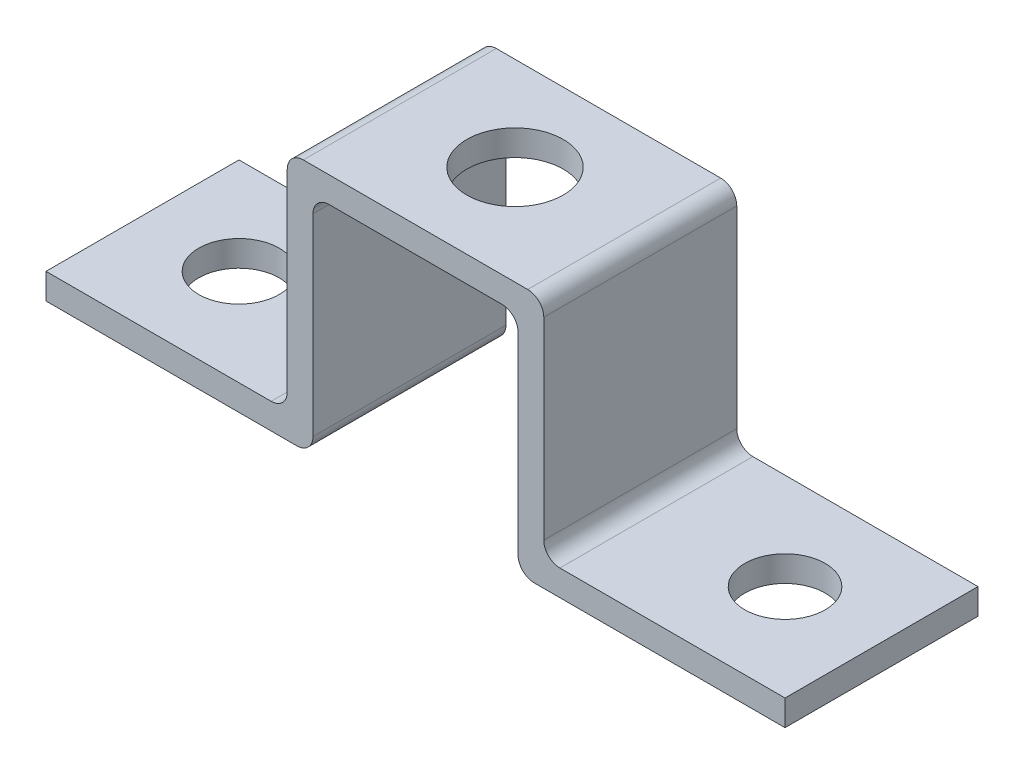
ISO-10303-21;
HEADER;
FILE_DESCRIPTION(('STEP AP214'),'2;1');
FILE_NAME('part.step','',(''),(''),'','','');
FILE_SCHEMA(('AUTOMOTIVE_DESIGN { 1 0 10303 214 1 1 1 1 }'));
ENDSEC;
DATA;
#1=APPLICATION_CONTEXT('core data for automotive mechanical design processes');
#2=APPLICATION_PROTOCOL_DEFINITION('international standard','automotive_design',2000,#1);
#3=PRODUCT_CONTEXT('',#1,'mechanical');
#4=PRODUCT('Part','Part','',(#3));
#5=PRODUCT_RELATED_PRODUCT_CATEGORY('part','',(#4));
#6=PRODUCT_DEFINITION_FORMATION('','',#4);
#7=PRODUCT_DEFINITION_CONTEXT('part definition',#1,'design');
#8=PRODUCT_DEFINITION('design','',#6,#7);
#9=PRODUCT_DEFINITION_SHAPE('','',#8);
#10=(LENGTH_UNIT() NAMED_UNIT(*) SI_UNIT(.MILLI.,.METRE.));
#11=(NAMED_UNIT(*) PLANE_ANGLE_UNIT() SI_UNIT($,.RADIAN.));
#12=(NAMED_UNIT(*) SI_UNIT($,.STERADIAN.) SOLID_ANGLE_UNIT());
#13=UNCERTAINTY_MEASURE_WITH_UNIT(LENGTH_MEASURE(1.E-05),#10,'distance_accuracy_value','');
#14=(GEOMETRIC_REPRESENTATION_CONTEXT(3) GLOBAL_UNCERTAINTY_ASSIGNED_CONTEXT((#13)) GLOBAL_UNIT_ASSIGNED_CONTEXT((#10,
#11,#12)) REPRESENTATION_CONTEXT('',''));
#15=CARTESIAN_POINT('',(0.,0.,0.));
#16=DIRECTION('',(0.,0.,1.));
#17=DIRECTION('',(1.,0.,0.));
#18=AXIS2_PLACEMENT_3D('',#15,#16,#17);
#19=CARTESIAN_POINT('',(-22.9767896358443,1.25105074490057,12.));
#20=DIRECTION('',(1.,0.,0.));
#21=DIRECTION('',(0.,0.,-1.));
#22=AXIS2_PLACEMENT_3D('',#19,#20,#21);
#23=PLANE('',#22);
#24=DIRECTION('',(0.,-1.,0.));
#25=VECTOR('',#24,1.);
#26=CARTESIAN_POINT('',(-22.9767896358443,1.25105074490057,0.));
#27=LINE('',#26,#25);
#28=CARTESIAN_POINT('',(-22.9767896358443,1.25105074490057,0.));
#29=VERTEX_POINT('',#28);
#30=CARTESIAN_POINT('',(-22.9767896358443,-0.348949255099432,0.));
#31=VERTEX_POINT('',#30);
#32=EDGE_CURVE('E194',#29,#31,#27,.T.);
#33=ORIENTED_EDGE('',*,*,#32,.T.);
#34=DIRECTION('',(0.,0.,-1.));
#35=VECTOR('',#34,1.);
#36=CARTESIAN_POINT('',(-22.9767896358443,-0.348949255099432,12.));
#37=LINE('',#36,#35);
#38=CARTESIAN_POINT('',(-22.9767896358443,-0.348949255099432,12.));
#39=VERTEX_POINT('',#38);
#40=EDGE_CURVE('E174',#39,#31,#37,.T.);
#41=ORIENTED_EDGE('',*,*,#40,.F.);
#42=DIRECTION('',(0.,-1.,0.));
#43=VECTOR('',#42,1.);
#44=CARTESIAN_POINT('',(-22.9767896358443,1.25105074490057,12.));
#45=LINE('',#44,#43);
#46=CARTESIAN_POINT('',(-22.9767896358443,1.25105074490057,12.));
#47=VERTEX_POINT('',#46);
#48=EDGE_CURVE('E181',#47,#39,#45,.T.);
#49=ORIENTED_EDGE('',*,*,#48,.F.);
#50=DIRECTION('',(0.,0.,-1.));
#51=VECTOR('',#50,1.);
#52=CARTESIAN_POINT('',(-22.9767896358443,1.25105074490057,12.));
#53=LINE('',#52,#51);
#54=EDGE_CURVE('E299',#47,#29,#53,.T.);
#55=ORIENTED_EDGE('',*,*,#54,.T.);
#56=EDGE_LOOP('',(#33,#41,#49,#55));
#57=FACE_BOUND('',#56,.T.);
#58=ADVANCED_FACE('F32',(#57),#23,.F.);
#59=CARTESIAN_POINT('',(-22.9767896358443,-0.348949255099432,12.));
#60=DIRECTION('',(0.,1.,0.));
#61=DIRECTION('',(0.,0.,1.));
#62=AXIS2_PLACEMENT_3D('',#59,#60,#61);
#63=PLANE('',#62);
#64=CARTESIAN_POINT('',(-16.9767896358443,-0.348949255099432,6.));
#65=DIRECTION('',(0.,1.,0.));
#66=DIRECTION('',(0.,0.,1.));
#67=AXIS2_PLACEMENT_3D('',#64,#65,#66);
#68=CIRCLE('',#67,2.5);
#69=CARTESIAN_POINT('',(-16.9767896358443,-0.348949255099432,8.5));
#70=VERTEX_POINT('',#69);
#71=EDGE_CURVE('E320',#70,#70,#68,.T.);
#72=ORIENTED_EDGE('',*,*,#71,.T.);
#73=EDGE_LOOP('',(#72));
#74=FACE_BOUND('',#73,.T.);
#75=DIRECTION('',(1.,0.,0.));
#76=VECTOR('',#75,1.);
#77=CARTESIAN_POINT('',(-22.9767896358443,-0.348949255099432,0.));
#78=LINE('',#77,#76);
#79=CARTESIAN_POINT('',(-7.37678963584429,-0.348949255099432,0.));
#80=VERTEX_POINT('',#79);
#81=EDGE_CURVE('E317',#31,#80,#78,.T.);
#82=ORIENTED_EDGE('',*,*,#81,.T.);
#83=DIRECTION('',(0.,0.,-1.));
#84=VECTOR('',#83,1.);
#85=CARTESIAN_POINT('',(-7.37678963584429,-0.348949255099432,12.));
#86=LINE('',#85,#84);
#87=CARTESIAN_POINT('',(-7.37678963584429,-0.348949255099432,12.));
#88=VERTEX_POINT('',#87);
#89=EDGE_CURVE('E177',#80,#88,#86,.F.);
#90=ORIENTED_EDGE('',*,*,#89,.T.);
#91=DIRECTION('',(1.,0.,0.));
#92=VECTOR('',#91,1.);
#93=CARTESIAN_POINT('',(-22.9767896358443,-0.348949255099432,12.));
#94=LINE('',#93,#92);
#95=EDGE_CURVE('E169',#39,#88,#94,.T.);
#96=ORIENTED_EDGE('',*,*,#95,.F.);
#97=ORIENTED_EDGE('',*,*,#40,.T.);
#98=EDGE_LOOP('',(#82,#90,#96,#97));
#99=FACE_BOUND('',#98,.T.);
#100=ADVANCED_FACE('F172',(#74,#99),#63,.F.);
#101=CARTESIAN_POINT('',(-6.37678963584429,-0.348949255099432,12.));
#102=DIRECTION('',(-1.,0.,0.));
#103=DIRECTION('',(0.,0.,1.));
#104=AXIS2_PLACEMENT_3D('',#101,#102,#103);
#105=PLANE('',#104);
#106=DIRECTION('',(0.,1.,0.));
#107=VECTOR('',#106,1.);
#108=CARTESIAN_POINT('',(-6.37678963584429,-0.348949255099432,12.));
#109=LINE('',#108,#107);
#110=CARTESIAN_POINT('',(-6.37678963584429,0.651050744900568,12.));
#111=VERTEX_POINT('',#110);
#112=CARTESIAN_POINT('',(-6.37678963584429,12.6510507449006,12.));
#113=VERTEX_POINT('',#112);
#114=EDGE_CURVE('E180',#111,#113,#109,.T.);
#115=ORIENTED_EDGE('',*,*,#114,.F.);
#116=DIRECTION('',(0.,0.,-1.));
#117=VECTOR('',#116,1.);
#118=CARTESIAN_POINT('',(-6.37678963584429,0.651050744900568,12.));
#119=LINE('',#118,#117);
#120=CARTESIAN_POINT('',(-6.37678963584429,0.651050744900568,0.));
#121=VERTEX_POINT('',#120);
#122=EDGE_CURVE('E235',#111,#121,#119,.T.);
#123=ORIENTED_EDGE('',*,*,#122,.T.);
#124=DIRECTION('',(0.,1.,0.));
#125=VECTOR('',#124,1.);
#126=CARTESIAN_POINT('',(-6.37678963584429,-0.348949255099432,0.));
#127=LINE('',#126,#125);
#128=CARTESIAN_POINT('',(-6.37678963584429,12.6510507449006,0.));
#129=VERTEX_POINT('',#128);
#130=EDGE_CURVE('E315',#121,#129,#127,.T.);
#131=ORIENTED_EDGE('',*,*,#130,.T.);
#132=DIRECTION('',(0.,0.,-1.));
#133=VECTOR('',#132,1.);
#134=CARTESIAN_POINT('',(-6.37678963584429,12.6510507449006,12.));
#135=LINE('',#134,#133);
#136=EDGE_CURVE('E227',#129,#113,#135,.F.);
#137=ORIENTED_EDGE('',*,*,#136,.T.);
#138=EDGE_LOOP('',(#115,#123,#131,#137));
#139=FACE_BOUND('',#138,.T.);
#140=ADVANCED_FACE('F391',(#139),#105,.F.);
#141=CARTESIAN_POINT('',(-6.37678963584429,13.6510507449006,12.));
#142=DIRECTION('',(0.,1.,0.));
#143=DIRECTION('',(0.,0.,1.));
#144=AXIS2_PLACEMENT_3D('',#141,#142,#143);
#145=PLANE('',#144);
#146=CARTESIAN_POINT('',(0.,13.6510507449006,5.81262031073493));
#147=DIRECTION('',(0.,1.,0.));
#148=DIRECTION('',(0.,0.,1.));
#149=AXIS2_PLACEMENT_3D('',#146,#147,#148);
#150=CIRCLE('',#149,3.);
#151=CARTESIAN_POINT('',(0.,13.6510507449006,8.81262031073493));
#152=VERTEX_POINT('',#151);
#153=EDGE_CURVE('E347',#152,#152,#150,.T.);
#154=ORIENTED_EDGE('',*,*,#153,.T.);
#155=EDGE_LOOP('',(#154));
#156=FACE_BOUND('',#155,.T.);
#157=DIRECTION('',(1.,0.,0.));
#158=VECTOR('',#157,1.);
#159=CARTESIAN_POINT('',(-6.37678963584429,13.6510507449006,0.));
#160=LINE('',#159,#158);
#161=CARTESIAN_POINT('',(-5.37678963584429,13.6510507449006,0.));
#162=VERTEX_POINT('',#161);
#163=CARTESIAN_POINT('',(5.37678963584429,13.6510507449006,0.));
#164=VERTEX_POINT('',#163);
#165=EDGE_CURVE('E312',#162,#164,#160,.T.);
#166=ORIENTED_EDGE('',*,*,#165,.T.);
#167=DIRECTION('',(0.,0.,-1.));
#168=VECTOR('',#167,1.);
#169=CARTESIAN_POINT('',(5.37678963584429,13.6510507449006,12.));
#170=LINE('',#169,#168);
#171=CARTESIAN_POINT('',(5.37678963584429,13.6510507449006,12.));
#172=VERTEX_POINT('',#171);
#173=EDGE_CURVE('E257',#164,#172,#170,.F.);
#174=ORIENTED_EDGE('',*,*,#173,.T.);
#175=DIRECTION('',(1.,0.,0.));
#176=VECTOR('',#175,1.);
#177=CARTESIAN_POINT('',(-6.37678963584429,13.6510507449006,12.));
#178=LINE('',#177,#176);
#179=CARTESIAN_POINT('',(-5.37678963584429,13.6510507449006,12.));
#180=VERTEX_POINT('',#179);
#181=EDGE_CURVE('E335',#180,#172,#178,.T.);
#182=ORIENTED_EDGE('',*,*,#181,.F.);
#183=DIRECTION('',(0.,0.,-1.));
#184=VECTOR('',#183,1.);
#185=CARTESIAN_POINT('',(-5.37678963584429,13.6510507449006,0.));
#186=LINE('',#185,#184);
#187=EDGE_CURVE('E224',#180,#162,#186,.T.);
#188=ORIENTED_EDGE('',*,*,#187,.T.);
#189=EDGE_LOOP('',(#166,#174,#182,#188));
#190=FACE_BOUND('',#189,.T.);
#191=ADVANCED_FACE('F356',(#156,#190),#145,.F.);
#192=CARTESIAN_POINT('',(6.37678963584429,-0.348949255099432,12.));
#193=DIRECTION('',(1.,0.,0.));
#194=DIRECTION('',(0.,0.,-1.));
#195=AXIS2_PLACEMENT_3D('',#192,#193,#194);
#196=PLANE('',#195);
#197=DIRECTION('',(0.,-1.,0.));
#198=VECTOR('',#197,1.);
#199=CARTESIAN_POINT('',(6.37678963584429,-0.348949255099432,12.));
#200=LINE('',#199,#198);
#201=CARTESIAN_POINT('',(6.37678963584429,12.6510507449006,12.));
#202=VERTEX_POINT('',#201);
#203=CARTESIAN_POINT('',(6.37678963584429,0.651050744900568,12.));
#204=VERTEX_POINT('',#203);
#205=EDGE_CURVE('E333',#202,#204,#200,.T.);
#206=ORIENTED_EDGE('',*,*,#205,.F.);
#207=DIRECTION('',(0.,0.,-1.));
#208=VECTOR('',#207,1.);
#209=CARTESIAN_POINT('',(6.37678963584429,12.6510507449006,0.));
#210=LINE('',#209,#208);
#211=CARTESIAN_POINT('',(6.37678963584429,12.6510507449006,0.));
#212=VERTEX_POINT('',#211);
#213=EDGE_CURVE('E254',#202,#212,#210,.T.);
#214=ORIENTED_EDGE('',*,*,#213,.T.);
#215=DIRECTION('',(0.,-1.,0.));
#216=VECTOR('',#215,1.);
#217=CARTESIAN_POINT('',(6.37678963584429,-0.348949255099432,0.));
#218=LINE('',#217,#216);
#219=CARTESIAN_POINT('',(6.37678963584429,0.651050744900568,0.));
#220=VERTEX_POINT('',#219);
#221=EDGE_CURVE('E308',#212,#220,#218,.T.);
#222=ORIENTED_EDGE('',*,*,#221,.T.);
#223=DIRECTION('',(0.,0.,-1.));
#224=VECTOR('',#223,1.);
#225=CARTESIAN_POINT('',(6.37678963584429,0.651050744900568,12.));
#226=LINE('',#225,#224);
#227=EDGE_CURVE('E249',#220,#204,#226,.F.);
#228=ORIENTED_EDGE('',*,*,#227,.T.);
#229=EDGE_LOOP('',(#206,#214,#222,#228));
#230=FACE_BOUND('',#229,.T.);
#231=ADVANCED_FACE('F423',(#230),#196,.F.);
#232=CARTESIAN_POINT('',(22.9767896358443,-0.348949255099432,12.));
#233=DIRECTION('',(0.,1.,0.));
#234=DIRECTION('',(0.,0.,1.));
#235=AXIS2_PLACEMENT_3D('',#232,#233,#234);
#236=PLANE('',#235);
#237=CARTESIAN_POINT('',(16.9767896358443,-0.348949255099432,6.));
#238=DIRECTION('',(0.,1.,0.));
#239=DIRECTION('',(0.,0.,1.));
#240=AXIS2_PLACEMENT_3D('',#237,#238,#239);
#241=CIRCLE('',#240,2.5);
#242=CARTESIAN_POINT('',(16.9767896358443,-0.348949255099432,8.5));
#243=VERTEX_POINT('',#242);
#244=EDGE_CURVE('E341',#243,#243,#241,.T.);
#245=ORIENTED_EDGE('',*,*,#244,.T.);
#246=EDGE_LOOP('',(#245));
#247=FACE_BOUND('',#246,.T.);
#248=DIRECTION('',(1.,0.,0.));
#249=VECTOR('',#248,1.);
#250=CARTESIAN_POINT('',(22.9767896358443,-0.348949255099432,12.));
#251=LINE('',#250,#249);
#252=CARTESIAN_POINT('',(7.37678963584429,-0.348949255099432,12.));
#253=VERTEX_POINT('',#252);
#254=CARTESIAN_POINT('',(22.9767896358443,-0.348949255099432,12.));
#255=VERTEX_POINT('',#254);
#256=EDGE_CURVE('E331',#253,#255,#251,.T.);
#257=ORIENTED_EDGE('',*,*,#256,.F.);
#258=DIRECTION('',(0.,0.,-1.));
#259=VECTOR('',#258,1.);
#260=CARTESIAN_POINT('',(7.37678963584429,-0.348949255099432,12.));
#261=LINE('',#260,#259);
#262=CARTESIAN_POINT('',(7.37678963584429,-0.348949255099432,0.));
#263=VERTEX_POINT('',#262);
#264=EDGE_CURVE('E243',#253,#263,#261,.T.);
#265=ORIENTED_EDGE('',*,*,#264,.T.);
#266=DIRECTION('',(1.,0.,0.));
#267=VECTOR('',#266,1.);
#268=CARTESIAN_POINT('',(22.9767896358443,-0.348949255099432,0.));
#269=LINE('',#268,#267);
#270=CARTESIAN_POINT('',(22.9767896358443,-0.348949255099432,0.));
#271=VERTEX_POINT('',#270);
#272=EDGE_CURVE('E307',#263,#271,#269,.T.);
#273=ORIENTED_EDGE('',*,*,#272,.T.);
#274=DIRECTION('',(0.,0.,-1.));
#275=VECTOR('',#274,1.);
#276=CARTESIAN_POINT('',(22.9767896358443,-0.348949255099432,12.));
#277=LINE('',#276,#275);
#278=EDGE_CURVE('E196',#255,#271,#277,.T.);
#279=ORIENTED_EDGE('',*,*,#278,.F.);
#280=EDGE_LOOP('',(#257,#265,#273,#279));
#281=FACE_BOUND('',#280,.T.);
#282=ADVANCED_FACE('F431',(#247,#281),#236,.F.);
#283=CARTESIAN_POINT('',(22.9767896358443,1.25105074490057,12.));
#284=DIRECTION('',(-1.,0.,0.));
#285=DIRECTION('',(0.,0.,1.));
#286=AXIS2_PLACEMENT_3D('',#283,#284,#285);
#287=PLANE('',#286);
#288=DIRECTION('',(0.,1.,0.));
#289=VECTOR('',#288,1.);
#290=CARTESIAN_POINT('',(22.9767896358443,1.25105074490057,0.));
#291=LINE('',#290,#289);
#292=CARTESIAN_POINT('',(22.9767896358443,1.25105074490057,0.));
#293=VERTEX_POINT('',#292);
#294=EDGE_CURVE('E292',#271,#293,#291,.T.);
#295=ORIENTED_EDGE('',*,*,#294,.T.);
#296=DIRECTION('',(0.,0.,-1.));
#297=VECTOR('',#296,1.);
#298=CARTESIAN_POINT('',(22.9767896358443,1.25105074490057,12.));
#299=LINE('',#298,#297);
#300=CARTESIAN_POINT('',(22.9767896358443,1.25105074490057,12.));
#301=VERTEX_POINT('',#300);
#302=EDGE_CURVE('E202',#301,#293,#299,.T.);
#303=ORIENTED_EDGE('',*,*,#302,.F.);
#304=DIRECTION('',(0.,1.,0.));
#305=VECTOR('',#304,1.);
#306=CARTESIAN_POINT('',(22.9767896358443,1.25105074490057,12.));
#307=LINE('',#306,#305);
#308=EDGE_CURVE('E329',#255,#301,#307,.T.);
#309=ORIENTED_EDGE('',*,*,#308,.F.);
#310=ORIENTED_EDGE('',*,*,#278,.T.);
#311=EDGE_LOOP('',(#295,#303,#309,#310));
#312=FACE_BOUND('',#311,.T.);
#313=ADVANCED_FACE('F432',(#312),#287,.F.);
#314=CARTESIAN_POINT('',(22.9767896358443,1.25105074490057,12.));
#315=DIRECTION('',(0.,-1.,0.));
#316=DIRECTION('',(0.,0.,-1.));
#317=AXIS2_PLACEMENT_3D('',#314,#315,#316);
#318=PLANE('',#317);
#319=CARTESIAN_POINT('',(16.9767896358443,1.25105074490057,6.));
#320=DIRECTION('',(0.,1.,0.));
#321=DIRECTION('',(0.,0.,1.));
#322=AXIS2_PLACEMENT_3D('',#319,#320,#321);
#323=CIRCLE('',#322,2.5);
#324=CARTESIAN_POINT('',(16.9767896358443,1.25105074490057,8.5));
#325=VERTEX_POINT('',#324);
#326=EDGE_CURVE('E344',#325,#325,#323,.T.);
#327=ORIENTED_EDGE('',*,*,#326,.F.);
#328=EDGE_LOOP('',(#327));
#329=FACE_BOUND('',#328,.T.);
#330=DIRECTION('',(-1.,0.,0.));
#331=VECTOR('',#330,1.);
#332=CARTESIAN_POINT('',(22.9767896358443,1.25105074490057,0.));
#333=LINE('',#332,#331);
#334=CARTESIAN_POINT('',(8.97678963584429,1.25105074490057,0.));
#335=VERTEX_POINT('',#334);
#336=EDGE_CURVE('E288',#293,#335,#333,.T.);
#337=ORIENTED_EDGE('',*,*,#336,.T.);
#338=DIRECTION('',(0.,0.,-1.));
#339=VECTOR('',#338,1.);
#340=CARTESIAN_POINT('',(8.97678963584429,1.25105074490057,12.));
#341=LINE('',#340,#339);
#342=CARTESIAN_POINT('',(8.97678963584429,1.25105074490057,12.));
#343=VERTEX_POINT('',#342);
#344=EDGE_CURVE('E47',#335,#343,#341,.F.);
#345=ORIENTED_EDGE('',*,*,#344,.T.);
#346=DIRECTION('',(-1.,0.,0.));
#347=VECTOR('',#346,1.);
#348=CARTESIAN_POINT('',(22.9767896358443,1.25105074490057,12.));
#349=LINE('',#348,#347);
#350=EDGE_CURVE('E303',#301,#343,#349,.T.);
#351=ORIENTED_EDGE('',*,*,#350,.F.);
#352=ORIENTED_EDGE('',*,*,#302,.T.);
#353=EDGE_LOOP('',(#337,#345,#351,#352));
#354=FACE_BOUND('',#353,.T.);
#355=ADVANCED_FACE('F302',(#329,#354),#318,.F.);
#356=CARTESIAN_POINT('',(7.97678963584429,1.25105074490057,12.));
#357=DIRECTION('',(-1.,0.,0.));
#358=DIRECTION('',(0.,0.,1.));
#359=AXIS2_PLACEMENT_3D('',#356,#357,#358);
#360=PLANE('',#359);
#361=DIRECTION('',(0.,1.,0.));
#362=VECTOR('',#361,1.);
#363=CARTESIAN_POINT('',(7.97678963584429,1.25105074490057,12.));
#364=LINE('',#363,#362);
#365=CARTESIAN_POINT('',(7.97678963584429,2.25105074490057,12.));
#366=VERTEX_POINT('',#365);
#367=CARTESIAN_POINT('',(7.97678963584429,14.2510507449006,12.));
#368=VERTEX_POINT('',#367);
#369=EDGE_CURVE('E280',#366,#368,#364,.T.);
#370=ORIENTED_EDGE('',*,*,#369,.F.);
#371=DIRECTION('',(0.,0.,-1.));
#372=VECTOR('',#371,1.);
#373=CARTESIAN_POINT('',(7.97678963584429,2.25105074490057,0.));
#374=LINE('',#373,#372);
#375=CARTESIAN_POINT('',(7.97678963584429,2.25105074490057,0.));
#376=VERTEX_POINT('',#375);
#377=EDGE_CURVE('E272',#366,#376,#374,.T.);
#378=ORIENTED_EDGE('',*,*,#377,.T.);
#379=DIRECTION('',(0.,1.,0.));
#380=VECTOR('',#379,1.);
#381=CARTESIAN_POINT('',(7.97678963584429,1.25105074490057,0.));
#382=LINE('',#381,#380);
#383=CARTESIAN_POINT('',(7.97678963584429,14.2510507449006,0.));
#384=VERTEX_POINT('',#383);
#385=EDGE_CURVE('E279',#376,#384,#382,.T.);
#386=ORIENTED_EDGE('',*,*,#385,.T.);
#387=DIRECTION('',(0.,0.,-1.));
#388=VECTOR('',#387,1.);
#389=CARTESIAN_POINT('',(7.97678963584429,14.2510507449006,12.));
#390=LINE('',#389,#388);
#391=EDGE_CURVE('E219',#384,#368,#390,.F.);
#392=ORIENTED_EDGE('',*,*,#391,.T.);
#393=EDGE_LOOP('',(#370,#378,#386,#392));
#394=FACE_BOUND('',#393,.T.);
#395=ADVANCED_FACE('F278',(#394),#360,.F.);
#396=CARTESIAN_POINT('',(-7.97678963584429,15.2510507449006,12.));
#397=DIRECTION('',(0.,-1.,0.));
#398=DIRECTION('',(0.,0.,-1.));
#399=AXIS2_PLACEMENT_3D('',#396,#397,#398);
#400=PLANE('',#399);
#401=CARTESIAN_POINT('',(0.,15.2510507449006,5.81262031073493));
#402=DIRECTION('',(0.,1.,0.));
#403=DIRECTION('',(0.,0.,1.));
#404=AXIS2_PLACEMENT_3D('',#401,#402,#403);
#405=CIRCLE('',#404,3.);
#406=CARTESIAN_POINT('',(0.,15.2510507449006,8.81262031073493));
#407=VERTEX_POINT('',#406);
#408=EDGE_CURVE('E350',#407,#407,#405,.T.);
#409=ORIENTED_EDGE('',*,*,#408,.F.);
#410=EDGE_LOOP('',(#409));
#411=FACE_BOUND('',#410,.T.);
#412=DIRECTION('',(-1.,0.,0.));
#413=VECTOR('',#412,1.);
#414=CARTESIAN_POINT('',(-7.97678963584429,15.2510507449006,12.));
#415=LINE('',#414,#413);
#416=CARTESIAN_POINT('',(6.97678963584429,15.2510507449006,12.));
#417=VERTEX_POINT('',#416);
#418=CARTESIAN_POINT('',(-6.97678963584429,15.2510507449006,12.));
#419=VERTEX_POINT('',#418);
#420=EDGE_CURVE('E325',#417,#419,#415,.T.);
#421=ORIENTED_EDGE('',*,*,#420,.F.);
#422=DIRECTION('',(0.,0.,-1.));
#423=VECTOR('',#422,1.);
#424=CARTESIAN_POINT('',(6.97678963584429,15.2510507449006,12.));
#425=LINE('',#424,#423);
#426=CARTESIAN_POINT('',(6.97678963584429,15.2510507449006,0.));
#427=VERTEX_POINT('',#426);
#428=EDGE_CURVE('E213',#417,#427,#425,.T.);
#429=ORIENTED_EDGE('',*,*,#428,.T.);
#430=DIRECTION('',(-1.,0.,0.));
#431=VECTOR('',#430,1.);
#432=CARTESIAN_POINT('',(-7.97678963584429,15.2510507449006,0.));
#433=LINE('',#432,#431);
#434=CARTESIAN_POINT('',(-6.97678963584429,15.2510507449006,0.));
#435=VERTEX_POINT('',#434);
#436=EDGE_CURVE('E287',#427,#435,#433,.T.);
#437=ORIENTED_EDGE('',*,*,#436,.T.);
#438=DIRECTION('',(0.,0.,-1.));
#439=VECTOR('',#438,1.);
#440=CARTESIAN_POINT('',(-6.97678963584429,15.2510507449006,12.));
#441=LINE('',#440,#439);
#442=EDGE_CURVE('E208',#435,#419,#441,.F.);
#443=ORIENTED_EDGE('',*,*,#442,.T.);
#444=EDGE_LOOP('',(#421,#429,#437,#443));
#445=FACE_BOUND('',#444,.T.);
#446=ADVANCED_FACE('F367',(#411,#445),#400,.F.);
#447=CARTESIAN_POINT('',(-7.97678963584429,1.25105074490057,12.));
#448=DIRECTION('',(1.,0.,0.));
#449=DIRECTION('',(0.,0.,-1.));
#450=AXIS2_PLACEMENT_3D('',#447,#448,#449);
#451=PLANE('',#450);
#452=DIRECTION('',(0.,-1.,0.));
#453=VECTOR('',#452,1.);
#454=CARTESIAN_POINT('',(-7.97678963584429,1.25105074490057,0.));
#455=LINE('',#454,#453);
#456=CARTESIAN_POINT('',(-7.97678963584429,14.2510507449006,0.));
#457=VERTEX_POINT('',#456);
#458=CARTESIAN_POINT('',(-7.97678963584429,2.25105074490057,0.));
#459=VERTEX_POINT('',#458);
#460=EDGE_CURVE('E290',#457,#459,#455,.T.);
#461=ORIENTED_EDGE('',*,*,#460,.T.);
#462=DIRECTION('',(0.,0.,-1.));
#463=VECTOR('',#462,1.);
#464=CARTESIAN_POINT('',(-7.97678963584429,2.25105074490057,12.));
#465=LINE('',#464,#463);
#466=CARTESIAN_POINT('',(-7.97678963584429,2.25105074490057,12.));
#467=VERTEX_POINT('',#466);
#468=EDGE_CURVE('E266',#459,#467,#465,.F.);
#469=ORIENTED_EDGE('',*,*,#468,.T.);
#470=DIRECTION('',(0.,-1.,0.));
#471=VECTOR('',#470,1.);
#472=CARTESIAN_POINT('',(-7.97678963584429,1.25105074490057,12.));
#473=LINE('',#472,#471);
#474=CARTESIAN_POINT('',(-7.97678963584429,14.2510507449006,12.));
#475=VERTEX_POINT('',#474);
#476=EDGE_CURVE('E322',#475,#467,#473,.T.);
#477=ORIENTED_EDGE('',*,*,#476,.F.);
#478=DIRECTION('',(0.,0.,-1.));
#479=VECTOR('',#478,1.);
#480=CARTESIAN_POINT('',(-7.97678963584429,14.2510507449006,12.));
#481=LINE('',#480,#479);
#482=EDGE_CURVE('E195',#475,#457,#481,.T.);
#483=ORIENTED_EDGE('',*,*,#482,.T.);
#484=EDGE_LOOP('',(#461,#469,#477,#483));
#485=FACE_BOUND('',#484,.T.);
#486=ADVANCED_FACE('F370',(#485),#451,.F.);
#487=CARTESIAN_POINT('',(-22.9767896358443,1.25105074490057,12.));
#488=DIRECTION('',(0.,-1.,0.));
#489=DIRECTION('',(0.,0.,-1.));
#490=AXIS2_PLACEMENT_3D('',#487,#488,#489);
#491=PLANE('',#490);
#492=CARTESIAN_POINT('',(-16.9767896358443,1.25105074490057,6.));
#493=DIRECTION('',(0.,1.,0.));
#494=DIRECTION('',(0.,0.,1.));
#495=AXIS2_PLACEMENT_3D('',#492,#493,#494);
#496=CIRCLE('',#495,2.5);
#497=CARTESIAN_POINT('',(-16.9767896358443,1.25105074490057,8.5));
#498=VERTEX_POINT('',#497);
#499=EDGE_CURVE('E338',#498,#498,#496,.T.);
#500=ORIENTED_EDGE('',*,*,#499,.F.);
#501=EDGE_LOOP('',(#500));
#502=FACE_BOUND('',#501,.T.);
#503=DIRECTION('',(-1.,0.,0.));
#504=VECTOR('',#503,1.);
#505=CARTESIAN_POINT('',(-22.9767896358443,1.25105074490057,12.));
#506=LINE('',#505,#504);
#507=CARTESIAN_POINT('',(-8.97678963584429,1.25105074490057,12.));
#508=VERTEX_POINT('',#507);
#509=EDGE_CURVE('E187',#508,#47,#506,.T.);
#510=ORIENTED_EDGE('',*,*,#509,.F.);
#511=DIRECTION('',(0.,0.,-1.));
#512=VECTOR('',#511,1.);
#513=CARTESIAN_POINT('',(-8.97678963584429,1.25105074490057,0.));
#514=LINE('',#513,#512);
#515=CARTESIAN_POINT('',(-8.97678963584429,1.25105074490057,0.));
#516=VERTEX_POINT('',#515);
#517=EDGE_CURVE('E263',#508,#516,#514,.T.);
#518=ORIENTED_EDGE('',*,*,#517,.T.);
#519=DIRECTION('',(-1.,0.,0.));
#520=VECTOR('',#519,1.);
#521=CARTESIAN_POINT('',(-22.9767896358443,1.25105074490057,0.));
#522=LINE('',#521,#520);
#523=EDGE_CURVE('E191',#516,#29,#522,.T.);
#524=ORIENTED_EDGE('',*,*,#523,.T.);
#525=ORIENTED_EDGE('',*,*,#54,.F.);
#526=EDGE_LOOP('',(#510,#518,#524,#525));
#527=FACE_BOUND('',#526,.T.);
#528=ADVANCED_FACE('F462',(#502,#527),#491,.F.);
#529=CARTESIAN_POINT('',(-22.9767896358443,-0.348949255099432,12.));
#530=DIRECTION('',(0.,0.,1.));
#531=DIRECTION('',(1.,0.,0.));
#532=AXIS2_PLACEMENT_3D('',#529,#530,#531);
#533=PLANE('',#532);
#534=ORIENTED_EDGE('',*,*,#181,.T.);
#535=CARTESIAN_POINT('',(5.37678963584429,12.6510507449006,12.));
#536=DIRECTION('',(0.,0.,1.));
#537=DIRECTION('',(1.,0.,0.));
#538=AXIS2_PLACEMENT_3D('',#535,#536,#537);
#539=CIRCLE('',#538,1.);
#540=EDGE_CURVE('E261',#172,#202,#539,.F.);
#541=ORIENTED_EDGE('',*,*,#540,.T.);
#542=ORIENTED_EDGE('',*,*,#205,.T.);
#543=CARTESIAN_POINT('',(7.37678963584429,0.651050744900568,12.));
#544=DIRECTION('',(0.,0.,1.));
#545=DIRECTION('',(1.,0.,0.));
#546=AXIS2_PLACEMENT_3D('',#543,#544,#545);
#547=CIRCLE('',#546,1.);
#548=EDGE_CURVE('E252',#204,#253,#547,.T.);
#549=ORIENTED_EDGE('',*,*,#548,.T.);
#550=ORIENTED_EDGE('',*,*,#256,.T.);
#551=ORIENTED_EDGE('',*,*,#308,.T.);
#552=ORIENTED_EDGE('',*,*,#350,.T.);
#553=CARTESIAN_POINT('',(8.97678963584429,2.25105074490057,12.));
#554=DIRECTION('',(0.,0.,1.));
#555=DIRECTION('',(1.,0.,0.));
#556=AXIS2_PLACEMENT_3D('',#553,#554,#555);
#557=CIRCLE('',#556,1.);
#558=EDGE_CURVE('E11',#343,#366,#557,.F.);
#559=ORIENTED_EDGE('',*,*,#558,.T.);
#560=ORIENTED_EDGE('',*,*,#369,.T.);
#561=CARTESIAN_POINT('',(6.97678963584429,14.2510507449006,12.));
#562=DIRECTION('',(0.,0.,1.));
#563=DIRECTION('',(1.,0.,0.));
#564=AXIS2_PLACEMENT_3D('',#561,#562,#563);
#565=CIRCLE('',#564,1.);
#566=EDGE_CURVE('E222',#368,#417,#565,.T.);
#567=ORIENTED_EDGE('',*,*,#566,.T.);
#568=ORIENTED_EDGE('',*,*,#420,.T.);
#569=CARTESIAN_POINT('',(-6.97678963584429,14.2510507449006,12.));
#570=DIRECTION('',(0.,0.,1.));
#571=DIRECTION('',(1.,0.,0.));
#572=AXIS2_PLACEMENT_3D('',#569,#570,#571);
#573=CIRCLE('',#572,1.);
#574=EDGE_CURVE('E211',#419,#475,#573,.T.);
#575=ORIENTED_EDGE('',*,*,#574,.T.);
#576=ORIENTED_EDGE('',*,*,#476,.T.);
#577=CARTESIAN_POINT('',(-8.97678963584429,2.25105074490057,12.));
#578=DIRECTION('',(0.,0.,1.));
#579=DIRECTION('',(1.,0.,0.));
#580=AXIS2_PLACEMENT_3D('',#577,#578,#579);
#581=CIRCLE('',#580,1.);
#582=EDGE_CURVE('E270',#467,#508,#581,.F.);
#583=ORIENTED_EDGE('',*,*,#582,.T.);
#584=ORIENTED_EDGE('',*,*,#509,.T.);
#585=ORIENTED_EDGE('',*,*,#48,.T.);
#586=ORIENTED_EDGE('',*,*,#95,.T.);
#587=CARTESIAN_POINT('',(-7.37678963584429,0.651050744900568,12.));
#588=DIRECTION('',(0.,0.,1.));
#589=DIRECTION('',(1.,0.,0.));
#590=AXIS2_PLACEMENT_3D('',#587,#588,#589);
#591=CIRCLE('',#590,1.);
#592=EDGE_CURVE('E241',#88,#111,#591,.T.);
#593=ORIENTED_EDGE('',*,*,#592,.T.);
#594=ORIENTED_EDGE('',*,*,#114,.T.);
#595=CARTESIAN_POINT('',(-5.37678963584429,12.6510507449006,12.));
#596=DIRECTION('',(0.,0.,1.));
#597=DIRECTION('',(1.,0.,0.));
#598=AXIS2_PLACEMENT_3D('',#595,#596,#597);
#599=CIRCLE('',#598,1.);
#600=EDGE_CURVE('E233',#113,#180,#599,.F.);
#601=ORIENTED_EDGE('',*,*,#600,.T.);
#602=EDGE_LOOP('',(#534,#541,#542,#549,#550,#551,#552,#559,#560,#567,#568,#575,#576,#583,#584,
#585,#586,#593,#594,#601));
#603=FACE_BOUND('',#602,.T.);
#604=ADVANCED_FACE('F185',(#603),#533,.T.);
#605=CARTESIAN_POINT('',(-22.9767896358443,-0.348949255099432,0.));
#606=DIRECTION('',(0.,0.,1.));
#607=DIRECTION('',(1.,0.,0.));
#608=AXIS2_PLACEMENT_3D('',#605,#606,#607);
#609=PLANE('',#608);
#610=ORIENTED_EDGE('',*,*,#272,.F.);
#611=CARTESIAN_POINT('',(7.37678963584429,0.651050744900568,0.));
#612=DIRECTION('',(0.,0.,1.));
#613=DIRECTION('',(1.,0.,0.));
#614=AXIS2_PLACEMENT_3D('',#611,#612,#613);
#615=CIRCLE('',#614,1.);
#616=EDGE_CURVE('E246',#263,#220,#615,.F.);
#617=ORIENTED_EDGE('',*,*,#616,.T.);
#618=ORIENTED_EDGE('',*,*,#221,.F.);
#619=CARTESIAN_POINT('',(5.37678963584429,12.6510507449006,0.));
#620=DIRECTION('',(0.,0.,1.));
#621=DIRECTION('',(1.,0.,0.));
#622=AXIS2_PLACEMENT_3D('',#619,#620,#621);
#623=CIRCLE('',#622,1.);
#624=EDGE_CURVE('E259',#212,#164,#623,.T.);
#625=ORIENTED_EDGE('',*,*,#624,.T.);
#626=ORIENTED_EDGE('',*,*,#165,.F.);
#627=CARTESIAN_POINT('',(-5.37678963584429,12.6510507449006,0.));
#628=DIRECTION('',(0.,0.,1.));
#629=DIRECTION('',(1.,0.,0.));
#630=AXIS2_PLACEMENT_3D('',#627,#628,#629);
#631=CIRCLE('',#630,1.);
#632=EDGE_CURVE('E230',#162,#129,#631,.T.);
#633=ORIENTED_EDGE('',*,*,#632,.T.);
#634=ORIENTED_EDGE('',*,*,#130,.F.);
#635=CARTESIAN_POINT('',(-7.37678963584429,0.651050744900568,0.));
#636=DIRECTION('',(0.,0.,1.));
#637=DIRECTION('',(1.,0.,0.));
#638=AXIS2_PLACEMENT_3D('',#635,#636,#637);
#639=CIRCLE('',#638,1.);
#640=EDGE_CURVE('E238',#121,#80,#639,.F.);
#641=ORIENTED_EDGE('',*,*,#640,.T.);
#642=ORIENTED_EDGE('',*,*,#81,.F.);
#643=ORIENTED_EDGE('',*,*,#32,.F.);
#644=ORIENTED_EDGE('',*,*,#523,.F.);
#645=CARTESIAN_POINT('',(-8.97678963584429,2.25105074490057,0.));
#646=DIRECTION('',(0.,0.,1.));
#647=DIRECTION('',(1.,0.,0.));
#648=AXIS2_PLACEMENT_3D('',#645,#646,#647);
#649=CIRCLE('',#648,1.);
#650=EDGE_CURVE('E268',#516,#459,#649,.T.);
#651=ORIENTED_EDGE('',*,*,#650,.T.);
#652=ORIENTED_EDGE('',*,*,#460,.F.);
#653=CARTESIAN_POINT('',(-6.97678963584429,14.2510507449006,0.));
#654=DIRECTION('',(0.,0.,1.));
#655=DIRECTION('',(1.,0.,0.));
#656=AXIS2_PLACEMENT_3D('',#653,#654,#655);
#657=CIRCLE('',#656,1.);
#658=EDGE_CURVE('E199',#457,#435,#657,.F.);
#659=ORIENTED_EDGE('',*,*,#658,.T.);
#660=ORIENTED_EDGE('',*,*,#436,.F.);
#661=CARTESIAN_POINT('',(6.97678963584429,14.2510507449006,0.));
#662=DIRECTION('',(0.,0.,1.));
#663=DIRECTION('',(1.,0.,0.));
#664=AXIS2_PLACEMENT_3D('',#661,#662,#663);
#665=CIRCLE('',#664,1.);
#666=EDGE_CURVE('E216',#427,#384,#665,.F.);
#667=ORIENTED_EDGE('',*,*,#666,.T.);
#668=ORIENTED_EDGE('',*,*,#385,.F.);
#669=CARTESIAN_POINT('',(8.97678963584429,2.25105074490057,0.));
#670=DIRECTION('',(0.,0.,1.));
#671=DIRECTION('',(1.,0.,0.));
#672=AXIS2_PLACEMENT_3D('',#669,#670,#671);
#673=CIRCLE('',#672,1.);
#674=EDGE_CURVE('E40',#376,#335,#673,.T.);
#675=ORIENTED_EDGE('',*,*,#674,.T.);
#676=ORIENTED_EDGE('',*,*,#336,.F.);
#677=ORIENTED_EDGE('',*,*,#294,.F.);
#678=EDGE_LOOP('',(#610,#617,#618,#625,#626,#633,#634,#641,#642,#643,#644,#651,#652,#659,#660,
#667,#668,#675,#676,#677));
#679=FACE_BOUND('',#678,.T.);
#680=ADVANCED_FACE('F284',(#679),#609,.F.);
#681=CARTESIAN_POINT('',(-16.9767896358443,-0.348949255099432,6.));
#682=DIRECTION('',(0.,1.,0.));
#683=DIRECTION('',(0.,0.,1.));
#684=AXIS2_PLACEMENT_3D('',#681,#682,#683);
#685=CYLINDRICAL_SURFACE('',#684,2.5);
#686=ORIENTED_EDGE('',*,*,#71,.F.);
#687=EDGE_LOOP('',(#686));
#688=FACE_BOUND('',#687,.T.);
#689=ORIENTED_EDGE('',*,*,#499,.T.);
#690=EDGE_LOOP('',(#689));
#691=FACE_BOUND('',#690,.T.);
#692=ADVANCED_FACE('F583',(#688,#691),#685,.F.);
#693=CARTESIAN_POINT('',(16.9767896358443,-0.348949255099432,6.));
#694=DIRECTION('',(0.,1.,0.));
#695=DIRECTION('',(0.,0.,1.));
#696=AXIS2_PLACEMENT_3D('',#693,#694,#695);
#697=CYLINDRICAL_SURFACE('',#696,2.5);
#698=ORIENTED_EDGE('',*,*,#244,.F.);
#699=EDGE_LOOP('',(#698));
#700=FACE_BOUND('',#699,.T.);
#701=ORIENTED_EDGE('',*,*,#326,.T.);
#702=EDGE_LOOP('',(#701));
#703=FACE_BOUND('',#702,.T.);
#704=ADVANCED_FACE('F363',(#700,#703),#697,.F.);
#705=CARTESIAN_POINT('',(0.,13.6510507449006,5.81262031073493));
#706=DIRECTION('',(0.,1.,0.));
#707=DIRECTION('',(0.,0.,1.));
#708=AXIS2_PLACEMENT_3D('',#705,#706,#707);
#709=CYLINDRICAL_SURFACE('',#708,3.);
#710=ORIENTED_EDGE('',*,*,#153,.F.);
#711=EDGE_LOOP('',(#710));
#712=FACE_BOUND('',#711,.T.);
#713=ORIENTED_EDGE('',*,*,#408,.T.);
#714=EDGE_LOOP('',(#713));
#715=FACE_BOUND('',#714,.T.);
#716=ADVANCED_FACE('F359',(#712,#715),#709,.F.);
#717=CARTESIAN_POINT('',(-6.97678963584429,14.2510507449006,12.));
#718=DIRECTION('',(0.,0.,-1.));
#719=DIRECTION('',(-1.,0.,0.));
#720=AXIS2_PLACEMENT_3D('',#717,#718,#719);
#721=CYLINDRICAL_SURFACE('',#720,1.);
#722=ORIENTED_EDGE('',*,*,#574,.F.);
#723=ORIENTED_EDGE('',*,*,#442,.F.);
#724=ORIENTED_EDGE('',*,*,#658,.F.);
#725=ORIENTED_EDGE('',*,*,#482,.F.);
#726=EDGE_LOOP('',(#722,#723,#724,#725));
#727=FACE_BOUND('',#726,.T.);
#728=ADVANCED_FACE('F362',(#727),#721,.T.);
#729=CARTESIAN_POINT('',(6.97678963584429,14.2510507449006,12.));
#730=DIRECTION('',(0.,0.,-1.));
#731=DIRECTION('',(-1.,0.,0.));
#732=AXIS2_PLACEMENT_3D('',#729,#730,#731);
#733=CYLINDRICAL_SURFACE('',#732,1.);
#734=ORIENTED_EDGE('',*,*,#566,.F.);
#735=ORIENTED_EDGE('',*,*,#391,.F.);
#736=ORIENTED_EDGE('',*,*,#666,.F.);
#737=ORIENTED_EDGE('',*,*,#428,.F.);
#738=EDGE_LOOP('',(#734,#735,#736,#737));
#739=FACE_BOUND('',#738,.T.);
#740=ADVANCED_FACE('F378',(#739),#733,.T.);
#741=CARTESIAN_POINT('',(-5.37678963584429,12.6510507449006,12.));
#742=DIRECTION('',(0.,0.,1.));
#743=DIRECTION('',(1.,0.,0.));
#744=AXIS2_PLACEMENT_3D('',#741,#742,#743);
#745=CYLINDRICAL_SURFACE('',#744,1.);
#746=ORIENTED_EDGE('',*,*,#600,.F.);
#747=ORIENTED_EDGE('',*,*,#136,.F.);
#748=ORIENTED_EDGE('',*,*,#632,.F.);
#749=ORIENTED_EDGE('',*,*,#187,.F.);
#750=EDGE_LOOP('',(#746,#747,#748,#749));
#751=FACE_BOUND('',#750,.T.);
#752=ADVANCED_FACE('F401',(#751),#745,.F.);
#753=CARTESIAN_POINT('',(-7.37678963584429,0.651050744900568,12.));
#754=DIRECTION('',(0.,0.,-1.));
#755=DIRECTION('',(-1.,0.,0.));
#756=AXIS2_PLACEMENT_3D('',#753,#754,#755);
#757=CYLINDRICAL_SURFACE('',#756,1.);
#758=ORIENTED_EDGE('',*,*,#592,.F.);
#759=ORIENTED_EDGE('',*,*,#89,.F.);
#760=ORIENTED_EDGE('',*,*,#640,.F.);
#761=ORIENTED_EDGE('',*,*,#122,.F.);
#762=EDGE_LOOP('',(#758,#759,#760,#761));
#763=FACE_BOUND('',#762,.T.);
#764=ADVANCED_FACE('F404',(#763),#757,.T.);
#765=CARTESIAN_POINT('',(7.37678963584429,0.651050744900568,12.));
#766=DIRECTION('',(0.,0.,-1.));
#767=DIRECTION('',(-1.,0.,0.));
#768=AXIS2_PLACEMENT_3D('',#765,#766,#767);
#769=CYLINDRICAL_SURFACE('',#768,1.);
#770=ORIENTED_EDGE('',*,*,#548,.F.);
#771=ORIENTED_EDGE('',*,*,#227,.F.);
#772=ORIENTED_EDGE('',*,*,#616,.F.);
#773=ORIENTED_EDGE('',*,*,#264,.F.);
#774=EDGE_LOOP('',(#770,#771,#772,#773));
#775=FACE_BOUND('',#774,.T.);
#776=ADVANCED_FACE('F408',(#775),#769,.T.);
#777=CARTESIAN_POINT('',(5.37678963584429,12.6510507449006,12.));
#778=DIRECTION('',(0.,0.,1.));
#779=DIRECTION('',(1.,0.,0.));
#780=AXIS2_PLACEMENT_3D('',#777,#778,#779);
#781=CYLINDRICAL_SURFACE('',#780,1.);
#782=ORIENTED_EDGE('',*,*,#540,.F.);
#783=ORIENTED_EDGE('',*,*,#173,.F.);
#784=ORIENTED_EDGE('',*,*,#624,.F.);
#785=ORIENTED_EDGE('',*,*,#213,.F.);
#786=EDGE_LOOP('',(#782,#783,#784,#785));
#787=FACE_BOUND('',#786,.T.);
#788=ADVANCED_FACE('F384',(#787),#781,.F.);
#789=CARTESIAN_POINT('',(-8.97678963584429,2.25105074490057,12.));
#790=DIRECTION('',(0.,0.,1.));
#791=DIRECTION('',(1.,0.,0.));
#792=AXIS2_PLACEMENT_3D('',#789,#790,#791);
#793=CYLINDRICAL_SURFACE('',#792,1.);
#794=ORIENTED_EDGE('',*,*,#582,.F.);
#795=ORIENTED_EDGE('',*,*,#468,.F.);
#796=ORIENTED_EDGE('',*,*,#650,.F.);
#797=ORIENTED_EDGE('',*,*,#517,.F.);
#798=EDGE_LOOP('',(#794,#795,#796,#797));
#799=FACE_BOUND('',#798,.T.);
#800=ADVANCED_FACE('F380',(#799),#793,.F.);
#801=CARTESIAN_POINT('',(8.97678963584429,2.25105074490057,12.));
#802=DIRECTION('',(0.,0.,1.));
#803=DIRECTION('',(1.,0.,0.));
#804=AXIS2_PLACEMENT_3D('',#801,#802,#803);
#805=CYLINDRICAL_SURFACE('',#804,1.);
#806=ORIENTED_EDGE('',*,*,#558,.F.);
#807=ORIENTED_EDGE('',*,*,#344,.F.);
#808=ORIENTED_EDGE('',*,*,#674,.F.);
#809=ORIENTED_EDGE('',*,*,#377,.F.);
#810=EDGE_LOOP('',(#806,#807,#808,#809));
#811=FACE_BOUND('',#810,.T.);
#812=ADVANCED_FACE('F34',(#811),#805,.F.);
#813=CLOSED_SHELL('',(#58,#100,#140,#191,#231,#282,#313,#355,#395,#446,#486,#528,#604,#680,#692,
#704,#716,#728,#740,#752,#764,#776,#788,#800,#812));
#814=MANIFOLD_SOLID_BREP('B2',#813);
#815=ADVANCED_BREP_SHAPE_REPRESENTATION('',(#18,#814),#14);
#816=SHAPE_DEFINITION_REPRESENTATION(#9,#815);
ENDSEC;
END-ISO-10303-21;
